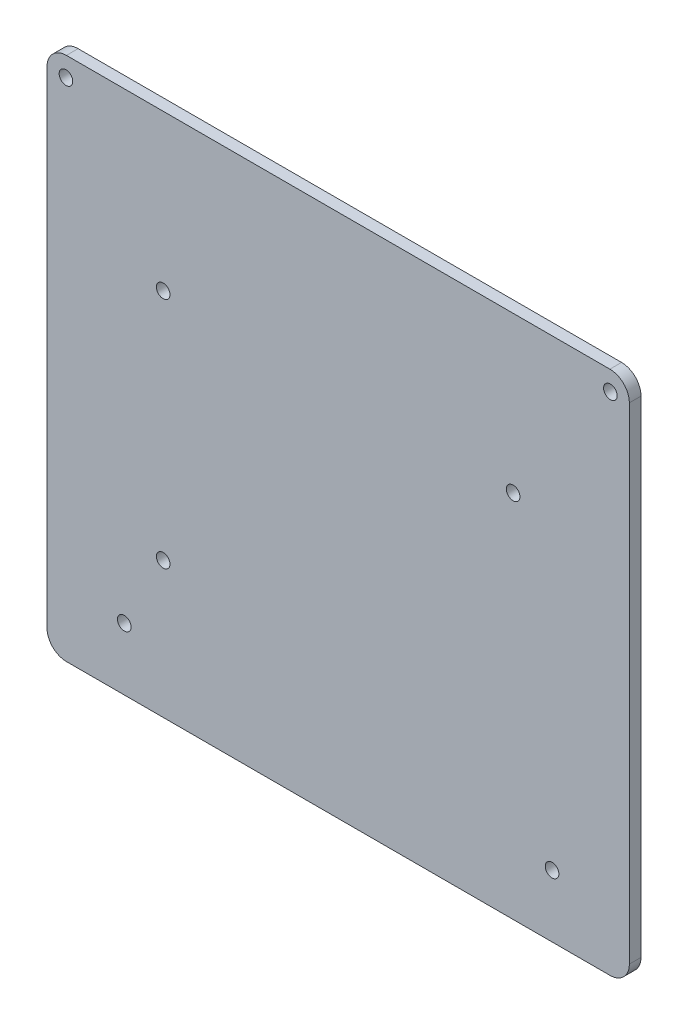
ISO-10303-21;
HEADER;
FILE_DESCRIPTION(('STEP AP214'),'2;1');
FILE_NAME('part.step','',(''),(''),'','','');
FILE_SCHEMA(('AUTOMOTIVE_DESIGN { 1 0 10303 214 1 1 1 1 }'));
ENDSEC;
DATA;
#1=APPLICATION_CONTEXT('core data for automotive mechanical design processes');
#2=APPLICATION_PROTOCOL_DEFINITION('international standard','automotive_design',2000,#1);
#3=PRODUCT_CONTEXT('',#1,'mechanical');
#4=PRODUCT('Part','Part','',(#3));
#5=PRODUCT_RELATED_PRODUCT_CATEGORY('part','',(#4));
#6=PRODUCT_DEFINITION_FORMATION('','',#4);
#7=PRODUCT_DEFINITION_CONTEXT('part definition',#1,'design');
#8=PRODUCT_DEFINITION('design','',#6,#7);
#9=PRODUCT_DEFINITION_SHAPE('','',#8);
#10=(LENGTH_UNIT() NAMED_UNIT(*) SI_UNIT(.MILLI.,.METRE.));
#11=(NAMED_UNIT(*) PLANE_ANGLE_UNIT() SI_UNIT($,.RADIAN.));
#12=(NAMED_UNIT(*) SI_UNIT($,.STERADIAN.) SOLID_ANGLE_UNIT());
#13=UNCERTAINTY_MEASURE_WITH_UNIT(LENGTH_MEASURE(1.E-05),#10,'distance_accuracy_value','');
#14=(GEOMETRIC_REPRESENTATION_CONTEXT(3) GLOBAL_UNCERTAINTY_ASSIGNED_CONTEXT((#13)) GLOBAL_UNIT_ASSIGNED_CONTEXT((#10,
#11,#12)) REPRESENTATION_CONTEXT('',''));
#15=CARTESIAN_POINT('',(0.,0.,0.));
#16=DIRECTION('',(0.,0.,1.));
#17=DIRECTION('',(1.,0.,0.));
#18=AXIS2_PLACEMENT_3D('',#15,#16,#17);
#19=CARTESIAN_POINT('',(0.,0.,3.));
#20=DIRECTION('',(0.,0.,1.));
#21=DIRECTION('',(1.,0.,0.));
#22=AXIS2_PLACEMENT_3D('',#19,#20,#21);
#23=PLANE('',#22);
#24=CARTESIAN_POINT('',(70.,62.5,3.));
#25=DIRECTION('',(0.,0.,1.));
#26=DIRECTION('',(1.,0.,0.));
#27=AXIS2_PLACEMENT_3D('',#24,#25,#26);
#28=CIRCLE('',#27,1.75);
#29=CARTESIAN_POINT('',(71.75,62.5,3.));
#30=VERTEX_POINT('',#29);
#31=EDGE_CURVE('E210',#30,#30,#28,.T.);
#32=ORIENTED_EDGE('',*,*,#31,.F.);
#33=EDGE_LOOP('',(#32));
#34=FACE_BOUND('',#33,.T.);
#35=CARTESIAN_POINT('',(-45.,27.5000000000001,3.));
#36=DIRECTION('',(0.,0.,1.));
#37=DIRECTION('',(1.,0.,0.));
#38=AXIS2_PLACEMENT_3D('',#35,#36,#37);
#39=CIRCLE('',#38,1.75);
#40=CARTESIAN_POINT('',(-43.25,27.5000000000001,3.));
#41=VERTEX_POINT('',#40);
#42=EDGE_CURVE('E198',#41,#41,#39,.T.);
#43=ORIENTED_EDGE('',*,*,#42,.F.);
#44=EDGE_LOOP('',(#43));
#45=FACE_BOUND('',#44,.T.);
#46=CARTESIAN_POINT('',(-55.,-51.5,3.));
#47=DIRECTION('',(0.,0.,1.));
#48=DIRECTION('',(-1.,0.,0.));
#49=AXIS2_PLACEMENT_3D('',#46,#47,#48);
#50=CIRCLE('',#49,1.75);
#51=CARTESIAN_POINT('',(-56.75,-51.5,3.));
#52=VERTEX_POINT('',#51);
#53=EDGE_CURVE('E187',#52,#52,#50,.T.);
#54=ORIENTED_EDGE('',*,*,#53,.F.);
#55=EDGE_LOOP('',(#54));
#56=FACE_BOUND('',#55,.T.);
#57=DIRECTION('',(1.,0.,0.));
#58=VECTOR('',#57,1.);
#59=CARTESIAN_POINT('',(-74.875,-67.5,3.));
#60=LINE('',#59,#58);
#61=CARTESIAN_POINT('',(-69.875,-67.5,3.));
#62=VERTEX_POINT('',#61);
#63=CARTESIAN_POINT('',(69.875,-67.5,3.));
#64=VERTEX_POINT('',#63);
#65=EDGE_CURVE('E173',#62,#64,#60,.T.);
#66=ORIENTED_EDGE('',*,*,#65,.T.);
#67=CARTESIAN_POINT('',(69.875,-62.5,3.));
#68=DIRECTION('',(0.,0.,1.));
#69=DIRECTION('',(1.,0.,0.));
#70=AXIS2_PLACEMENT_3D('',#67,#68,#69);
#71=CIRCLE('',#70,5.);
#72=CARTESIAN_POINT('',(74.875,-62.5,3.));
#73=VERTEX_POINT('',#72);
#74=EDGE_CURVE('E151',#64,#73,#71,.T.);
#75=ORIENTED_EDGE('',*,*,#74,.T.);
#76=DIRECTION('',(0.,1.,0.));
#77=VECTOR('',#76,1.);
#78=CARTESIAN_POINT('',(74.875,67.5,3.));
#79=LINE('',#78,#77);
#80=CARTESIAN_POINT('',(74.875,62.5,3.));
#81=VERTEX_POINT('',#80);
#82=EDGE_CURVE('E121',#73,#81,#79,.T.);
#83=ORIENTED_EDGE('',*,*,#82,.T.);
#84=CARTESIAN_POINT('',(69.875,62.5,3.));
#85=DIRECTION('',(0.,0.,1.));
#86=DIRECTION('',(1.,0.,0.));
#87=AXIS2_PLACEMENT_3D('',#84,#85,#86);
#88=CIRCLE('',#87,5.);
#89=CARTESIAN_POINT('',(69.875,67.5,3.));
#90=VERTEX_POINT('',#89);
#91=EDGE_CURVE('E57',#81,#90,#88,.T.);
#92=ORIENTED_EDGE('',*,*,#91,.T.);
#93=DIRECTION('',(-1.,0.,0.));
#94=VECTOR('',#93,1.);
#95=CARTESIAN_POINT('',(-74.875,67.5,3.));
#96=LINE('',#95,#94);
#97=CARTESIAN_POINT('',(-69.875,67.5,3.));
#98=VERTEX_POINT('',#97);
#99=EDGE_CURVE('E137',#90,#98,#96,.T.);
#100=ORIENTED_EDGE('',*,*,#99,.T.);
#101=CARTESIAN_POINT('',(-69.875,62.5,3.));
#102=DIRECTION('',(0.,0.,1.));
#103=DIRECTION('',(1.,0.,0.));
#104=AXIS2_PLACEMENT_3D('',#101,#102,#103);
#105=CIRCLE('',#104,5.);
#106=CARTESIAN_POINT('',(-74.875,62.5,3.));
#107=VERTEX_POINT('',#106);
#108=EDGE_CURVE('E147',#98,#107,#105,.T.);
#109=ORIENTED_EDGE('',*,*,#108,.T.);
#110=DIRECTION('',(0.,-1.,0.));
#111=VECTOR('',#110,1.);
#112=CARTESIAN_POINT('',(-74.875,67.5,3.));
#113=LINE('',#112,#111);
#114=CARTESIAN_POINT('',(-74.875,-62.5,3.));
#115=VERTEX_POINT('',#114);
#116=EDGE_CURVE('E131',#107,#115,#113,.T.);
#117=ORIENTED_EDGE('',*,*,#116,.T.);
#118=CARTESIAN_POINT('',(-69.875,-62.5,3.));
#119=DIRECTION('',(0.,0.,1.));
#120=DIRECTION('',(1.,0.,0.));
#121=AXIS2_PLACEMENT_3D('',#118,#119,#120);
#122=CIRCLE('',#121,5.);
#123=EDGE_CURVE('E149',#115,#62,#122,.T.);
#124=ORIENTED_EDGE('',*,*,#123,.T.);
#125=EDGE_LOOP('',(#66,#75,#83,#92,#100,#109,#117,#124));
#126=FACE_BOUND('',#125,.T.);
#127=CARTESIAN_POINT('',(55.,-51.5,3.));
#128=DIRECTION('',(0.,0.,1.));
#129=DIRECTION('',(1.,0.,0.));
#130=AXIS2_PLACEMENT_3D('',#127,#128,#129);
#131=CIRCLE('',#130,1.75);
#132=CARTESIAN_POINT('',(56.75,-51.5,3.));
#133=VERTEX_POINT('',#132);
#134=EDGE_CURVE('E182',#133,#133,#131,.T.);
#135=ORIENTED_EDGE('',*,*,#134,.F.);
#136=EDGE_LOOP('',(#135));
#137=FACE_BOUND('',#136,.T.);
#138=CARTESIAN_POINT('',(45.,27.5000000000001,3.));
#139=DIRECTION('',(0.,0.,1.));
#140=DIRECTION('',(1.,0.,0.));
#141=AXIS2_PLACEMENT_3D('',#138,#139,#140);
#142=CIRCLE('',#141,1.75);
#143=CARTESIAN_POINT('',(46.75,27.5000000000001,3.));
#144=VERTEX_POINT('',#143);
#145=EDGE_CURVE('E192',#144,#144,#142,.T.);
#146=ORIENTED_EDGE('',*,*,#145,.F.);
#147=EDGE_LOOP('',(#146));
#148=FACE_BOUND('',#147,.T.);
#149=CARTESIAN_POINT('',(-45.,-32.4999999999999,3.));
#150=DIRECTION('',(0.,0.,1.));
#151=DIRECTION('',(1.,0.,0.));
#152=AXIS2_PLACEMENT_3D('',#149,#150,#151);
#153=CIRCLE('',#152,1.75);
#154=CARTESIAN_POINT('',(-43.25,-32.4999999999999,3.));
#155=VERTEX_POINT('',#154);
#156=EDGE_CURVE('E204',#155,#155,#153,.T.);
#157=ORIENTED_EDGE('',*,*,#156,.F.);
#158=EDGE_LOOP('',(#157));
#159=FACE_BOUND('',#158,.T.);
#160=CARTESIAN_POINT('',(-70.,62.5,3.));
#161=DIRECTION('',(0.,0.,1.));
#162=DIRECTION('',(1.,0.,0.));
#163=AXIS2_PLACEMENT_3D('',#160,#161,#162);
#164=CIRCLE('',#163,1.75);
#165=CARTESIAN_POINT('',(-68.25,62.5,3.));
#166=VERTEX_POINT('',#165);
#167=EDGE_CURVE('E216',#166,#166,#164,.T.);
#168=ORIENTED_EDGE('',*,*,#167,.F.);
#169=EDGE_LOOP('',(#168));
#170=FACE_BOUND('',#169,.T.);
#171=ADVANCED_FACE('F37',(#34,#45,#56,#126,#137,#148,#159,#170),#23,.T.);
#172=CARTESIAN_POINT('',(0.,0.,0.));
#173=DIRECTION('',(0.,0.,1.));
#174=DIRECTION('',(1.,0.,0.));
#175=AXIS2_PLACEMENT_3D('',#172,#173,#174);
#176=PLANE('',#175);
#177=DIRECTION('',(0.,1.,0.));
#178=VECTOR('',#177,1.);
#179=CARTESIAN_POINT('',(74.875,67.5,0.));
#180=LINE('',#179,#178);
#181=CARTESIAN_POINT('',(74.875,-62.5,0.));
#182=VERTEX_POINT('',#181);
#183=CARTESIAN_POINT('',(74.875,62.5,0.));
#184=VERTEX_POINT('',#183);
#185=EDGE_CURVE('E119',#182,#184,#180,.T.);
#186=ORIENTED_EDGE('',*,*,#185,.F.);
#187=CARTESIAN_POINT('',(69.875,-62.5,0.));
#188=DIRECTION('',(0.,0.,1.));
#189=DIRECTION('',(1.,0.,0.));
#190=AXIS2_PLACEMENT_3D('',#187,#188,#189);
#191=CIRCLE('',#190,5.);
#192=CARTESIAN_POINT('',(69.875,-67.5,0.));
#193=VERTEX_POINT('',#192);
#194=EDGE_CURVE('E102',#182,#193,#191,.F.);
#195=ORIENTED_EDGE('',*,*,#194,.T.);
#196=DIRECTION('',(1.,0.,0.));
#197=VECTOR('',#196,1.);
#198=CARTESIAN_POINT('',(-74.875,-67.5,0.));
#199=LINE('',#198,#197);
#200=CARTESIAN_POINT('',(-69.875,-67.5,0.));
#201=VERTEX_POINT('',#200);
#202=EDGE_CURVE('E129',#201,#193,#199,.T.);
#203=ORIENTED_EDGE('',*,*,#202,.F.);
#204=CARTESIAN_POINT('',(-69.875,-62.5,0.));
#205=DIRECTION('',(0.,0.,1.));
#206=DIRECTION('',(1.,0.,0.));
#207=AXIS2_PLACEMENT_3D('',#204,#205,#206);
#208=CIRCLE('',#207,5.);
#209=CARTESIAN_POINT('',(-74.875,-62.5,0.));
#210=VERTEX_POINT('',#209);
#211=EDGE_CURVE('E113',#201,#210,#208,.F.);
#212=ORIENTED_EDGE('',*,*,#211,.T.);
#213=DIRECTION('',(0.,-1.,0.));
#214=VECTOR('',#213,1.);
#215=CARTESIAN_POINT('',(-74.875,67.5,0.));
#216=LINE('',#215,#214);
#217=CARTESIAN_POINT('',(-74.875,62.5,0.));
#218=VERTEX_POINT('',#217);
#219=EDGE_CURVE('E133',#218,#210,#216,.T.);
#220=ORIENTED_EDGE('',*,*,#219,.F.);
#221=CARTESIAN_POINT('',(-69.875,62.5,0.));
#222=DIRECTION('',(0.,0.,1.));
#223=DIRECTION('',(1.,0.,0.));
#224=AXIS2_PLACEMENT_3D('',#221,#222,#223);
#225=CIRCLE('',#224,5.);
#226=CARTESIAN_POINT('',(-69.875,67.5,0.));
#227=VERTEX_POINT('',#226);
#228=EDGE_CURVE('E140',#218,#227,#225,.F.);
#229=ORIENTED_EDGE('',*,*,#228,.T.);
#230=DIRECTION('',(-1.,0.,0.));
#231=VECTOR('',#230,1.);
#232=CARTESIAN_POINT('',(-74.875,67.5,0.));
#233=LINE('',#232,#231);
#234=CARTESIAN_POINT('',(69.875,67.5,0.));
#235=VERTEX_POINT('',#234);
#236=EDGE_CURVE('E128',#235,#227,#233,.T.);
#237=ORIENTED_EDGE('',*,*,#236,.F.);
#238=CARTESIAN_POINT('',(69.875,62.5,0.));
#239=DIRECTION('',(0.,0.,1.));
#240=DIRECTION('',(1.,0.,0.));
#241=AXIS2_PLACEMENT_3D('',#238,#239,#240);
#242=CIRCLE('',#241,5.);
#243=EDGE_CURVE('E122',#235,#184,#242,.F.);
#244=ORIENTED_EDGE('',*,*,#243,.T.);
#245=EDGE_LOOP('',(#186,#195,#203,#212,#220,#229,#237,#244));
#246=FACE_BOUND('',#245,.T.);
#247=CARTESIAN_POINT('',(55.,-51.5,0.));
#248=DIRECTION('',(0.,0.,1.));
#249=DIRECTION('',(1.,0.,0.));
#250=AXIS2_PLACEMENT_3D('',#247,#248,#249);
#251=CIRCLE('',#250,1.75);
#252=CARTESIAN_POINT('',(56.75,-51.5,0.));
#253=VERTEX_POINT('',#252);
#254=EDGE_CURVE('E178',#253,#253,#251,.T.);
#255=ORIENTED_EDGE('',*,*,#254,.T.);
#256=EDGE_LOOP('',(#255));
#257=FACE_BOUND('',#256,.T.);
#258=CARTESIAN_POINT('',(-55.,-51.5,0.));
#259=DIRECTION('',(0.,0.,1.));
#260=DIRECTION('',(-1.,0.,0.));
#261=AXIS2_PLACEMENT_3D('',#258,#259,#260);
#262=CIRCLE('',#261,1.75);
#263=CARTESIAN_POINT('',(-56.75,-51.5,0.));
#264=VERTEX_POINT('',#263);
#265=EDGE_CURVE('E189',#264,#264,#262,.T.);
#266=ORIENTED_EDGE('',*,*,#265,.T.);
#267=EDGE_LOOP('',(#266));
#268=FACE_BOUND('',#267,.T.);
#269=CARTESIAN_POINT('',(45.,27.5000000000001,0.));
#270=DIRECTION('',(0.,0.,1.));
#271=DIRECTION('',(1.,0.,0.));
#272=AXIS2_PLACEMENT_3D('',#269,#270,#271);
#273=CIRCLE('',#272,1.75);
#274=CARTESIAN_POINT('',(46.75,27.5000000000001,0.));
#275=VERTEX_POINT('',#274);
#276=EDGE_CURVE('E195',#275,#275,#273,.T.);
#277=ORIENTED_EDGE('',*,*,#276,.T.);
#278=EDGE_LOOP('',(#277));
#279=FACE_BOUND('',#278,.T.);
#280=CARTESIAN_POINT('',(-45.,27.5000000000001,0.));
#281=DIRECTION('',(0.,0.,1.));
#282=DIRECTION('',(1.,0.,0.));
#283=AXIS2_PLACEMENT_3D('',#280,#281,#282);
#284=CIRCLE('',#283,1.75);
#285=CARTESIAN_POINT('',(-43.25,27.5000000000001,0.));
#286=VERTEX_POINT('',#285);
#287=EDGE_CURVE('E201',#286,#286,#284,.T.);
#288=ORIENTED_EDGE('',*,*,#287,.T.);
#289=EDGE_LOOP('',(#288));
#290=FACE_BOUND('',#289,.T.);
#291=CARTESIAN_POINT('',(-45.,-32.4999999999999,0.));
#292=DIRECTION('',(0.,0.,1.));
#293=DIRECTION('',(1.,0.,0.));
#294=AXIS2_PLACEMENT_3D('',#291,#292,#293);
#295=CIRCLE('',#294,1.75);
#296=CARTESIAN_POINT('',(-43.25,-32.4999999999999,0.));
#297=VERTEX_POINT('',#296);
#298=EDGE_CURVE('E207',#297,#297,#295,.T.);
#299=ORIENTED_EDGE('',*,*,#298,.T.);
#300=EDGE_LOOP('',(#299));
#301=FACE_BOUND('',#300,.T.);
#302=CARTESIAN_POINT('',(70.,62.5,0.));
#303=DIRECTION('',(0.,0.,1.));
#304=DIRECTION('',(1.,0.,0.));
#305=AXIS2_PLACEMENT_3D('',#302,#303,#304);
#306=CIRCLE('',#305,1.75);
#307=CARTESIAN_POINT('',(71.75,62.5,0.));
#308=VERTEX_POINT('',#307);
#309=EDGE_CURVE('E213',#308,#308,#306,.T.);
#310=ORIENTED_EDGE('',*,*,#309,.T.);
#311=EDGE_LOOP('',(#310));
#312=FACE_BOUND('',#311,.T.);
#313=CARTESIAN_POINT('',(-70.,62.5,0.));
#314=DIRECTION('',(0.,0.,1.));
#315=DIRECTION('',(1.,0.,0.));
#316=AXIS2_PLACEMENT_3D('',#313,#314,#315);
#317=CIRCLE('',#316,1.75);
#318=CARTESIAN_POINT('',(-68.25,62.5,0.));
#319=VERTEX_POINT('',#318);
#320=EDGE_CURVE('E219',#319,#319,#317,.T.);
#321=ORIENTED_EDGE('',*,*,#320,.T.);
#322=EDGE_LOOP('',(#321));
#323=FACE_BOUND('',#322,.T.);
#324=ADVANCED_FACE('F125',(#246,#257,#268,#279,#290,#301,#312,#323),#176,.F.);
#325=CARTESIAN_POINT('',(-74.875,67.5,3.));
#326=DIRECTION('',(1.,0.,0.));
#327=DIRECTION('',(0.,0.,-1.));
#328=AXIS2_PLACEMENT_3D('',#325,#326,#327);
#329=PLANE('',#328);
#330=ORIENTED_EDGE('',*,*,#219,.T.);
#331=DIRECTION('',(0.,0.,-1.));
#332=VECTOR('',#331,1.);
#333=CARTESIAN_POINT('',(-74.875,-62.5,3.));
#334=LINE('',#333,#332);
#335=EDGE_CURVE('E156',#210,#115,#334,.F.);
#336=ORIENTED_EDGE('',*,*,#335,.T.);
#337=ORIENTED_EDGE('',*,*,#116,.F.);
#338=DIRECTION('',(0.,0.,-1.));
#339=VECTOR('',#338,1.);
#340=CARTESIAN_POINT('',(-74.875,62.5,3.));
#341=LINE('',#340,#339);
#342=EDGE_CURVE('E153',#107,#218,#341,.T.);
#343=ORIENTED_EDGE('',*,*,#342,.T.);
#344=EDGE_LOOP('',(#330,#336,#337,#343));
#345=FACE_BOUND('',#344,.T.);
#346=ADVANCED_FACE('F169',(#345),#329,.F.);
#347=CARTESIAN_POINT('',(-74.875,-67.5,3.));
#348=DIRECTION('',(0.,1.,0.));
#349=DIRECTION('',(0.,0.,1.));
#350=AXIS2_PLACEMENT_3D('',#347,#348,#349);
#351=PLANE('',#350);
#352=ORIENTED_EDGE('',*,*,#202,.T.);
#353=DIRECTION('',(0.,0.,-1.));
#354=VECTOR('',#353,1.);
#355=CARTESIAN_POINT('',(69.875,-67.5,3.));
#356=LINE('',#355,#354);
#357=EDGE_CURVE('E107',#193,#64,#356,.F.);
#358=ORIENTED_EDGE('',*,*,#357,.T.);
#359=ORIENTED_EDGE('',*,*,#65,.F.);
#360=DIRECTION('',(0.,0.,-1.));
#361=VECTOR('',#360,1.);
#362=CARTESIAN_POINT('',(-69.875,-67.5,3.));
#363=LINE('',#362,#361);
#364=EDGE_CURVE('E112',#62,#201,#363,.T.);
#365=ORIENTED_EDGE('',*,*,#364,.T.);
#366=EDGE_LOOP('',(#352,#358,#359,#365));
#367=FACE_BOUND('',#366,.T.);
#368=ADVANCED_FACE('F245',(#367),#351,.F.);
#369=CARTESIAN_POINT('',(74.875,67.5,3.));
#370=DIRECTION('',(-1.,0.,0.));
#371=DIRECTION('',(0.,0.,1.));
#372=AXIS2_PLACEMENT_3D('',#369,#370,#371);
#373=PLANE('',#372);
#374=ORIENTED_EDGE('',*,*,#82,.F.);
#375=DIRECTION('',(0.,0.,-1.));
#376=VECTOR('',#375,1.);
#377=CARTESIAN_POINT('',(74.875,-62.5,3.));
#378=LINE('',#377,#376);
#379=EDGE_CURVE('E106',#73,#182,#378,.T.);
#380=ORIENTED_EDGE('',*,*,#379,.T.);
#381=ORIENTED_EDGE('',*,*,#185,.T.);
#382=DIRECTION('',(0.,0.,-1.));
#383=VECTOR('',#382,1.);
#384=CARTESIAN_POINT('',(74.875,62.5,3.));
#385=LINE('',#384,#383);
#386=EDGE_CURVE('E123',#184,#81,#385,.F.);
#387=ORIENTED_EDGE('',*,*,#386,.T.);
#388=EDGE_LOOP('',(#374,#380,#381,#387));
#389=FACE_BOUND('',#388,.T.);
#390=ADVANCED_FACE('F118',(#389),#373,.F.);
#391=CARTESIAN_POINT('',(-74.875,67.5,3.));
#392=DIRECTION('',(0.,-1.,0.));
#393=DIRECTION('',(0.,0.,-1.));
#394=AXIS2_PLACEMENT_3D('',#391,#392,#393);
#395=PLANE('',#394);
#396=ORIENTED_EDGE('',*,*,#236,.T.);
#397=DIRECTION('',(0.,0.,-1.));
#398=VECTOR('',#397,1.);
#399=CARTESIAN_POINT('',(-69.875,67.5,3.));
#400=LINE('',#399,#398);
#401=EDGE_CURVE('E11',#227,#98,#400,.F.);
#402=ORIENTED_EDGE('',*,*,#401,.T.);
#403=ORIENTED_EDGE('',*,*,#99,.F.);
#404=DIRECTION('',(0.,0.,-1.));
#405=VECTOR('',#404,1.);
#406=CARTESIAN_POINT('',(69.875,67.5,3.));
#407=LINE('',#406,#405);
#408=EDGE_CURVE('E45',#90,#235,#407,.T.);
#409=ORIENTED_EDGE('',*,*,#408,.T.);
#410=EDGE_LOOP('',(#396,#402,#403,#409));
#411=FACE_BOUND('',#410,.T.);
#412=ADVANCED_FACE('F159',(#411),#395,.F.);
#413=CARTESIAN_POINT('',(55.,-51.5,3.));
#414=DIRECTION('',(0.,0.,-1.));
#415=DIRECTION('',(-1.,0.,0.));
#416=AXIS2_PLACEMENT_3D('',#413,#414,#415);
#417=CYLINDRICAL_SURFACE('',#416,1.75);
#418=ORIENTED_EDGE('',*,*,#134,.T.);
#419=EDGE_LOOP('',(#418));
#420=FACE_BOUND('',#419,.T.);
#421=ORIENTED_EDGE('',*,*,#254,.F.);
#422=EDGE_LOOP('',(#421));
#423=FACE_BOUND('',#422,.T.);
#424=ADVANCED_FACE('F238',(#420,#423),#417,.F.);
#425=CARTESIAN_POINT('',(-55.,-51.5,3.));
#426=DIRECTION('',(0.,0.,-1.));
#427=DIRECTION('',(-1.,0.,0.));
#428=AXIS2_PLACEMENT_3D('',#425,#426,#427);
#429=CYLINDRICAL_SURFACE('',#428,1.75);
#430=ORIENTED_EDGE('',*,*,#53,.T.);
#431=EDGE_LOOP('',(#430));
#432=FACE_BOUND('',#431,.T.);
#433=ORIENTED_EDGE('',*,*,#265,.F.);
#434=EDGE_LOOP('',(#433));
#435=FACE_BOUND('',#434,.T.);
#436=ADVANCED_FACE('F295',(#432,#435),#429,.F.);
#437=CARTESIAN_POINT('',(45.,27.5000000000001,3.));
#438=DIRECTION('',(0.,0.,-1.));
#439=DIRECTION('',(-1.,0.,0.));
#440=AXIS2_PLACEMENT_3D('',#437,#438,#439);
#441=CYLINDRICAL_SURFACE('',#440,1.75);
#442=ORIENTED_EDGE('',*,*,#145,.T.);
#443=EDGE_LOOP('',(#442));
#444=FACE_BOUND('',#443,.T.);
#445=ORIENTED_EDGE('',*,*,#276,.F.);
#446=EDGE_LOOP('',(#445));
#447=FACE_BOUND('',#446,.T.);
#448=ADVANCED_FACE('F292',(#444,#447),#441,.F.);
#449=CARTESIAN_POINT('',(-45.,27.5000000000001,3.));
#450=DIRECTION('',(0.,0.,-1.));
#451=DIRECTION('',(-1.,0.,0.));
#452=AXIS2_PLACEMENT_3D('',#449,#450,#451);
#453=CYLINDRICAL_SURFACE('',#452,1.75);
#454=ORIENTED_EDGE('',*,*,#42,.T.);
#455=EDGE_LOOP('',(#454));
#456=FACE_BOUND('',#455,.T.);
#457=ORIENTED_EDGE('',*,*,#287,.F.);
#458=EDGE_LOOP('',(#457));
#459=FACE_BOUND('',#458,.T.);
#460=ADVANCED_FACE('F274',(#456,#459),#453,.F.);
#461=CARTESIAN_POINT('',(-45.,-32.4999999999999,3.));
#462=DIRECTION('',(0.,0.,-1.));
#463=DIRECTION('',(-1.,0.,0.));
#464=AXIS2_PLACEMENT_3D('',#461,#462,#463);
#465=CYLINDRICAL_SURFACE('',#464,1.75);
#466=ORIENTED_EDGE('',*,*,#156,.T.);
#467=EDGE_LOOP('',(#466));
#468=FACE_BOUND('',#467,.T.);
#469=ORIENTED_EDGE('',*,*,#298,.F.);
#470=EDGE_LOOP('',(#469));
#471=FACE_BOUND('',#470,.T.);
#472=ADVANCED_FACE('F270',(#468,#471),#465,.F.);
#473=CARTESIAN_POINT('',(70.,62.5,3.));
#474=DIRECTION('',(0.,0.,-1.));
#475=DIRECTION('',(-1.,0.,0.));
#476=AXIS2_PLACEMENT_3D('',#473,#474,#475);
#477=CYLINDRICAL_SURFACE('',#476,1.75);
#478=ORIENTED_EDGE('',*,*,#31,.T.);
#479=EDGE_LOOP('',(#478));
#480=FACE_BOUND('',#479,.T.);
#481=ORIENTED_EDGE('',*,*,#309,.F.);
#482=EDGE_LOOP('',(#481));
#483=FACE_BOUND('',#482,.T.);
#484=ADVANCED_FACE('F273',(#480,#483),#477,.F.);
#485=CARTESIAN_POINT('',(-70.,62.5,3.));
#486=DIRECTION('',(0.,0.,-1.));
#487=DIRECTION('',(-1.,0.,0.));
#488=AXIS2_PLACEMENT_3D('',#485,#486,#487);
#489=CYLINDRICAL_SURFACE('',#488,1.75);
#490=ORIENTED_EDGE('',*,*,#167,.T.);
#491=EDGE_LOOP('',(#490));
#492=FACE_BOUND('',#491,.T.);
#493=ORIENTED_EDGE('',*,*,#320,.F.);
#494=EDGE_LOOP('',(#493));
#495=FACE_BOUND('',#494,.T.);
#496=ADVANCED_FACE('F225',(#492,#495),#489,.F.);
#497=CARTESIAN_POINT('',(69.875,-62.5,3.));
#498=DIRECTION('',(0.,0.,-1.));
#499=DIRECTION('',(-1.,0.,0.));
#500=AXIS2_PLACEMENT_3D('',#497,#498,#499);
#501=CYLINDRICAL_SURFACE('',#500,5.);
#502=ORIENTED_EDGE('',*,*,#74,.F.);
#503=ORIENTED_EDGE('',*,*,#357,.F.);
#504=ORIENTED_EDGE('',*,*,#194,.F.);
#505=ORIENTED_EDGE('',*,*,#379,.F.);
#506=EDGE_LOOP('',(#502,#503,#504,#505));
#507=FACE_BOUND('',#506,.T.);
#508=ADVANCED_FACE('F105',(#507),#501,.T.);
#509=CARTESIAN_POINT('',(-69.875,-62.5,3.));
#510=DIRECTION('',(0.,0.,-1.));
#511=DIRECTION('',(-1.,0.,0.));
#512=AXIS2_PLACEMENT_3D('',#509,#510,#511);
#513=CYLINDRICAL_SURFACE('',#512,5.);
#514=ORIENTED_EDGE('',*,*,#123,.F.);
#515=ORIENTED_EDGE('',*,*,#335,.F.);
#516=ORIENTED_EDGE('',*,*,#211,.F.);
#517=ORIENTED_EDGE('',*,*,#364,.F.);
#518=EDGE_LOOP('',(#514,#515,#516,#517));
#519=FACE_BOUND('',#518,.T.);
#520=ADVANCED_FACE('F253',(#519),#513,.T.);
#521=CARTESIAN_POINT('',(-69.875,62.5,3.));
#522=DIRECTION('',(0.,0.,-1.));
#523=DIRECTION('',(-1.,0.,0.));
#524=AXIS2_PLACEMENT_3D('',#521,#522,#523);
#525=CYLINDRICAL_SURFACE('',#524,5.);
#526=ORIENTED_EDGE('',*,*,#108,.F.);
#527=ORIENTED_EDGE('',*,*,#401,.F.);
#528=ORIENTED_EDGE('',*,*,#228,.F.);
#529=ORIENTED_EDGE('',*,*,#342,.F.);
#530=EDGE_LOOP('',(#526,#527,#528,#529));
#531=FACE_BOUND('',#530,.T.);
#532=ADVANCED_FACE('F166',(#531),#525,.T.);
#533=CARTESIAN_POINT('',(69.875,62.5,3.));
#534=DIRECTION('',(0.,0.,-1.));
#535=DIRECTION('',(-1.,0.,0.));
#536=AXIS2_PLACEMENT_3D('',#533,#534,#535);
#537=CYLINDRICAL_SURFACE('',#536,5.);
#538=ORIENTED_EDGE('',*,*,#91,.F.);
#539=ORIENTED_EDGE('',*,*,#386,.F.);
#540=ORIENTED_EDGE('',*,*,#243,.F.);
#541=ORIENTED_EDGE('',*,*,#408,.F.);
#542=EDGE_LOOP('',(#538,#539,#540,#541));
#543=FACE_BOUND('',#542,.T.);
#544=ADVANCED_FACE('F39',(#543),#537,.T.);
#545=CLOSED_SHELL('',(#171,#324,#346,#368,#390,#412,#424,#436,#448,#460,#472,#484,#496,#508,
#520,#532,#544));
#546=MANIFOLD_SOLID_BREP('B2',#545);
#547=ADVANCED_BREP_SHAPE_REPRESENTATION('',(#18,#546),#14);
#548=SHAPE_DEFINITION_REPRESENTATION(#9,#547);
ENDSEC;
END-ISO-10303-21;
